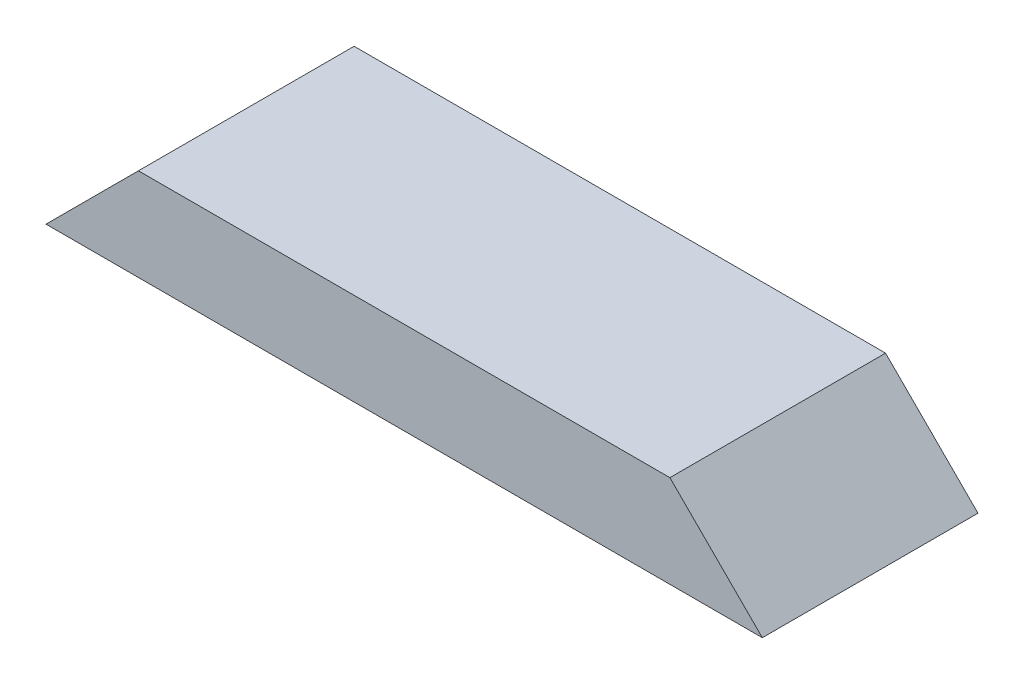
ISO-10303-21;
HEADER;
FILE_DESCRIPTION(('STEP AP214'),'2;1');
FILE_NAME('part.step','',(''),(''),'','','');
FILE_SCHEMA(('AUTOMOTIVE_DESIGN { 1 0 10303 214 1 1 1 1 }'));
ENDSEC;
DATA;
#1=APPLICATION_CONTEXT('core data for automotive mechanical design processes');
#2=APPLICATION_PROTOCOL_DEFINITION('international standard','automotive_design',2000,#1);
#3=PRODUCT_CONTEXT('',#1,'mechanical');
#4=PRODUCT('Part','Part','',(#3));
#5=PRODUCT_RELATED_PRODUCT_CATEGORY('part','',(#4));
#6=PRODUCT_DEFINITION_FORMATION('','',#4);
#7=PRODUCT_DEFINITION_CONTEXT('part definition',#1,'design');
#8=PRODUCT_DEFINITION('design','',#6,#7);
#9=PRODUCT_DEFINITION_SHAPE('','',#8);
#10=(LENGTH_UNIT() NAMED_UNIT(*) SI_UNIT(.MILLI.,.METRE.));
#11=(NAMED_UNIT(*) PLANE_ANGLE_UNIT() SI_UNIT($,.RADIAN.));
#12=(NAMED_UNIT(*) SI_UNIT($,.STERADIAN.) SOLID_ANGLE_UNIT());
#13=UNCERTAINTY_MEASURE_WITH_UNIT(LENGTH_MEASURE(1.E-05),#10,'distance_accuracy_value','');
#14=(GEOMETRIC_REPRESENTATION_CONTEXT(3) GLOBAL_UNCERTAINTY_ASSIGNED_CONTEXT((#13)) GLOBAL_UNIT_ASSIGNED_CONTEXT((#10,
#11,#12)) REPRESENTATION_CONTEXT('',''));
#15=CARTESIAN_POINT('',(0.,0.,0.));
#16=DIRECTION('',(0.,0.,1.));
#17=DIRECTION('',(1.,0.,0.));
#18=AXIS2_PLACEMENT_3D('',#15,#16,#17);
#19=CARTESIAN_POINT('',(0.,38.1,0.));
#20=DIRECTION('',(0.,0.,-1.));
#21=DIRECTION('',(-1.,0.,0.));
#22=AXIS2_PLACEMENT_3D('',#19,#20,#21);
#23=PLANE('',#22);
#24=DIRECTION('',(1.,0.,0.));
#25=VECTOR('',#24,1.);
#26=CARTESIAN_POINT('',(0.,38.1,0.));
#27=LINE('',#26,#25);
#28=CARTESIAN_POINT('',(38.1,38.1,0.));
#29=VERTEX_POINT('',#28);
#30=CARTESIAN_POINT('',(257.175,38.1,0.));
#31=VERTEX_POINT('',#30);
#32=EDGE_CURVE('E47',#29,#31,#27,.T.);
#33=ORIENTED_EDGE('',*,*,#32,.F.);
#34=DIRECTION('',(0.707106781186547,0.707106781186547,0.));
#35=VECTOR('',#34,1.);
#36=CARTESIAN_POINT('',(0.,0.,0.));
#37=LINE('',#36,#35);
#38=CARTESIAN_POINT('',(0.,0.,0.));
#39=VERTEX_POINT('',#38);
#40=EDGE_CURVE('E82',#39,#29,#37,.T.);
#41=ORIENTED_EDGE('',*,*,#40,.F.);
#42=DIRECTION('',(1.,0.,0.));
#43=VECTOR('',#42,1.);
#44=CARTESIAN_POINT('',(0.,0.,0.));
#45=LINE('',#44,#43);
#46=CARTESIAN_POINT('',(295.275,0.,0.));
#47=VERTEX_POINT('',#46);
#48=EDGE_CURVE('E87',#39,#47,#45,.T.);
#49=ORIENTED_EDGE('',*,*,#48,.T.);
#50=DIRECTION('',(0.707106781186548,-0.707106781186547,0.));
#51=VECTOR('',#50,1.);
#52=CARTESIAN_POINT('',(257.175,38.1,0.));
#53=LINE('',#52,#51);
#54=EDGE_CURVE('E63',#31,#47,#53,.T.);
#55=ORIENTED_EDGE('',*,*,#54,.F.);
#56=EDGE_LOOP('',(#33,#41,#49,#55));
#57=FACE_BOUND('',#56,.T.);
#58=ADVANCED_FACE('F39',(#57),#23,.F.);
#59=CARTESIAN_POINT('',(0.,38.1,-88.9));
#60=DIRECTION('',(0.,0.,1.));
#61=DIRECTION('',(1.,0.,0.));
#62=AXIS2_PLACEMENT_3D('',#59,#60,#61);
#63=PLANE('',#62);
#64=DIRECTION('',(-1.,0.,0.));
#65=VECTOR('',#64,1.);
#66=CARTESIAN_POINT('',(0.,0.,-88.9));
#67=LINE('',#66,#65);
#68=CARTESIAN_POINT('',(295.275,0.,-88.9));
#69=VERTEX_POINT('',#68);
#70=CARTESIAN_POINT('',(0.,0.,-88.9));
#71=VERTEX_POINT('',#70);
#72=EDGE_CURVE('E42',#69,#71,#67,.T.);
#73=ORIENTED_EDGE('',*,*,#72,.T.);
#74=DIRECTION('',(0.707106781186547,0.707106781186547,0.));
#75=VECTOR('',#74,1.);
#76=CARTESIAN_POINT('',(0.,0.,-88.9));
#77=LINE('',#76,#75);
#78=CARTESIAN_POINT('',(38.1,38.1,-88.9));
#79=VERTEX_POINT('',#78);
#80=EDGE_CURVE('E55',#71,#79,#77,.T.);
#81=ORIENTED_EDGE('',*,*,#80,.T.);
#82=DIRECTION('',(-1.,0.,0.));
#83=VECTOR('',#82,1.);
#84=CARTESIAN_POINT('',(0.,38.1,-88.9));
#85=LINE('',#84,#83);
#86=CARTESIAN_POINT('',(257.175,38.1,-88.9));
#87=VERTEX_POINT('',#86);
#88=EDGE_CURVE('E11',#87,#79,#85,.T.);
#89=ORIENTED_EDGE('',*,*,#88,.F.);
#90=DIRECTION('',(0.707106781186548,-0.707106781186547,0.));
#91=VECTOR('',#90,1.);
#92=CARTESIAN_POINT('',(257.175,38.1,-88.9));
#93=LINE('',#92,#91);
#94=EDGE_CURVE('E100',#87,#69,#93,.T.);
#95=ORIENTED_EDGE('',*,*,#94,.T.);
#96=EDGE_LOOP('',(#73,#81,#89,#95));
#97=FACE_BOUND('',#96,.T.);
#98=ADVANCED_FACE('F109',(#97),#63,.F.);
#99=CARTESIAN_POINT('',(0.,38.1,0.));
#100=DIRECTION('',(0.,-1.,0.));
#101=DIRECTION('',(0.,0.,-1.));
#102=AXIS2_PLACEMENT_3D('',#99,#100,#101);
#103=PLANE('',#102);
#104=ORIENTED_EDGE('',*,*,#88,.T.);
#105=DIRECTION('',(0.,0.,1.));
#106=VECTOR('',#105,1.);
#107=CARTESIAN_POINT('',(38.1,38.1,-88.9));
#108=LINE('',#107,#106);
#109=EDGE_CURVE('E88',#79,#29,#108,.T.);
#110=ORIENTED_EDGE('',*,*,#109,.T.);
#111=ORIENTED_EDGE('',*,*,#32,.T.);
#112=DIRECTION('',(0.,0.,1.));
#113=VECTOR('',#112,1.);
#114=CARTESIAN_POINT('',(257.175,38.1,-88.9));
#115=LINE('',#114,#113);
#116=EDGE_CURVE('E103',#87,#31,#115,.T.);
#117=ORIENTED_EDGE('',*,*,#116,.F.);
#118=EDGE_LOOP('',(#104,#110,#111,#117));
#119=FACE_BOUND('',#118,.T.);
#120=ADVANCED_FACE('F112',(#119),#103,.F.);
#121=CARTESIAN_POINT('',(0.,0.,0.));
#122=DIRECTION('',(0.,-1.,0.));
#123=DIRECTION('',(0.,0.,-1.));
#124=AXIS2_PLACEMENT_3D('',#121,#122,#123);
#125=PLANE('',#124);
#126=DIRECTION('',(0.,0.,1.));
#127=VECTOR('',#126,1.);
#128=CARTESIAN_POINT('',(0.,0.,0.));
#129=LINE('',#128,#127);
#130=EDGE_CURVE('E79',#71,#39,#129,.T.);
#131=ORIENTED_EDGE('',*,*,#130,.F.);
#132=ORIENTED_EDGE('',*,*,#72,.F.);
#133=DIRECTION('',(0.,0.,-1.));
#134=VECTOR('',#133,1.);
#135=CARTESIAN_POINT('',(295.275,0.,0.));
#136=LINE('',#135,#134);
#137=EDGE_CURVE('E96',#47,#69,#136,.T.);
#138=ORIENTED_EDGE('',*,*,#137,.F.);
#139=ORIENTED_EDGE('',*,*,#48,.F.);
#140=EDGE_LOOP('',(#131,#132,#138,#139));
#141=FACE_BOUND('',#140,.T.);
#142=ADVANCED_FACE('F95',(#141),#125,.T.);
#143=CARTESIAN_POINT('',(257.175,38.1,-88.9));
#144=DIRECTION('',(-0.707106781186547,-0.707106781186548,0.));
#145=DIRECTION('',(0.707106781186548,-0.707106781186547,0.));
#146=AXIS2_PLACEMENT_3D('',#143,#144,#145);
#147=PLANE('',#146);
#148=ORIENTED_EDGE('',*,*,#54,.T.);
#149=ORIENTED_EDGE('',*,*,#137,.T.);
#150=ORIENTED_EDGE('',*,*,#94,.F.);
#151=ORIENTED_EDGE('',*,*,#116,.T.);
#152=EDGE_LOOP('',(#148,#149,#150,#151));
#153=FACE_BOUND('',#152,.T.);
#154=ADVANCED_FACE('F113',(#153),#147,.F.);
#155=CARTESIAN_POINT('',(0.,0.,-88.9));
#156=DIRECTION('',(0.707106781186547,-0.707106781186547,0.));
#157=DIRECTION('',(0.707106781186548,0.707106781186548,0.));
#158=AXIS2_PLACEMENT_3D('',#155,#156,#157);
#159=PLANE('',#158);
#160=ORIENTED_EDGE('',*,*,#40,.T.);
#161=ORIENTED_EDGE('',*,*,#109,.F.);
#162=ORIENTED_EDGE('',*,*,#80,.F.);
#163=ORIENTED_EDGE('',*,*,#130,.T.);
#164=EDGE_LOOP('',(#160,#161,#162,#163));
#165=FACE_BOUND('',#164,.T.);
#166=ADVANCED_FACE('F81',(#165),#159,.F.);
#167=CLOSED_SHELL('',(#58,#98,#120,#142,#154,#166));
#168=MANIFOLD_SOLID_BREP('B2',#167);
#169=ADVANCED_BREP_SHAPE_REPRESENTATION('',(#18,#168),#14);
#170=SHAPE_DEFINITION_REPRESENTATION(#9,#169);
ENDSEC;
END-ISO-10303-21;
